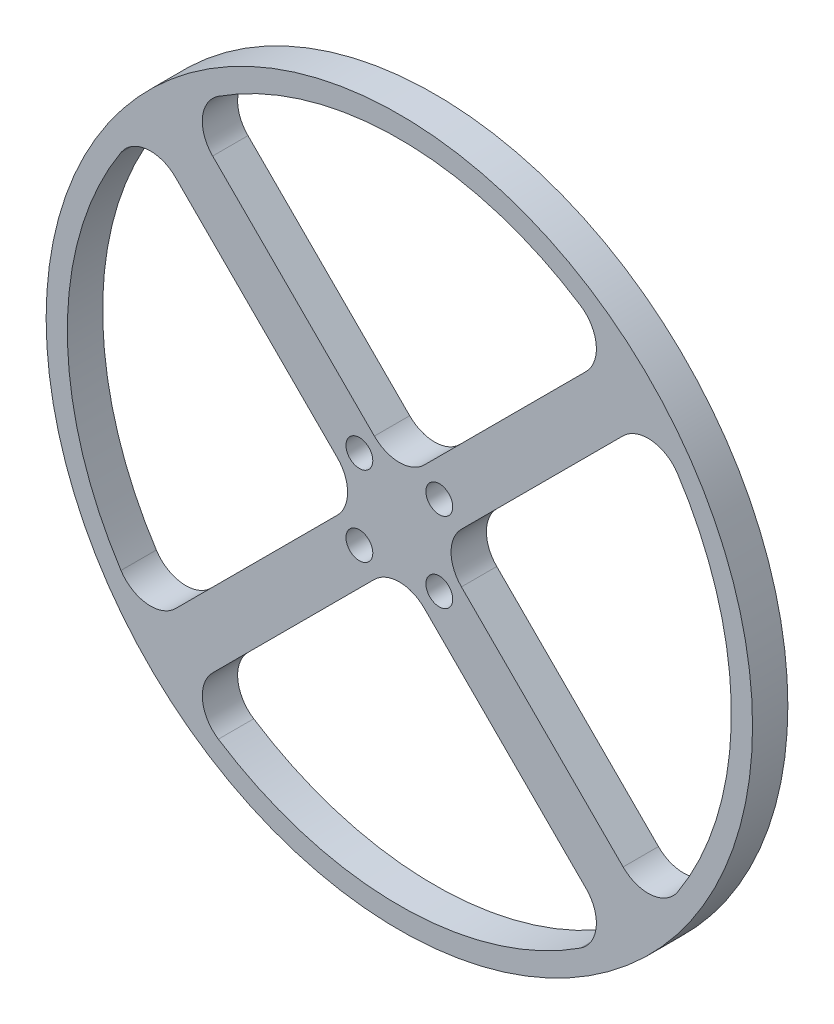
ISO-10303-21;
HEADER;
FILE_DESCRIPTION(('STEP AP214'),'2;1');
FILE_NAME('part.step','',(''),(''),'','','');
FILE_SCHEMA(('AUTOMOTIVE_DESIGN { 1 0 10303 214 1 1 1 1 }'));
ENDSEC;
DATA;
#1=APPLICATION_CONTEXT('core data for automotive mechanical design processes');
#2=APPLICATION_PROTOCOL_DEFINITION('international standard','automotive_design',2000,#1);
#3=PRODUCT_CONTEXT('',#1,'mechanical');
#4=PRODUCT('Part','Part','',(#3));
#5=PRODUCT_RELATED_PRODUCT_CATEGORY('part','',(#4));
#6=PRODUCT_DEFINITION_FORMATION('','',#4);
#7=PRODUCT_DEFINITION_CONTEXT('part definition',#1,'design');
#8=PRODUCT_DEFINITION('design','',#6,#7);
#9=PRODUCT_DEFINITION_SHAPE('','',#8);
#10=(LENGTH_UNIT() NAMED_UNIT(*) SI_UNIT(.MILLI.,.METRE.));
#11=(NAMED_UNIT(*) PLANE_ANGLE_UNIT() SI_UNIT($,.RADIAN.));
#12=(NAMED_UNIT(*) SI_UNIT($,.STERADIAN.) SOLID_ANGLE_UNIT());
#13=UNCERTAINTY_MEASURE_WITH_UNIT(LENGTH_MEASURE(1.E-05),#10,'distance_accuracy_value','');
#14=(GEOMETRIC_REPRESENTATION_CONTEXT(3) GLOBAL_UNCERTAINTY_ASSIGNED_CONTEXT((#13)) GLOBAL_UNIT_ASSIGNED_CONTEXT((#10,
#11,#12)) REPRESENTATION_CONTEXT('',''));
#15=CARTESIAN_POINT('',(0.,0.,0.));
#16=DIRECTION('',(0.,0.,1.));
#17=DIRECTION('',(1.,0.,0.));
#18=AXIS2_PLACEMENT_3D('',#15,#16,#17);
#19=CARTESIAN_POINT('',(0.,0.,5.));
#20=DIRECTION('',(0.,0.,1.));
#21=DIRECTION('',(1.,0.,0.));
#22=AXIS2_PLACEMENT_3D('',#19,#20,#21);
#23=PLANE('',#22);
#24=CARTESIAN_POINT('',(-5.65685424949235,-5.65685424949241,5.));
#25=DIRECTION('',(0.,0.,1.));
#26=DIRECTION('',(1.,0.,0.));
#27=AXIS2_PLACEMENT_3D('',#24,#25,#26);
#28=CIRCLE('',#27,1.9);
#29=CARTESIAN_POINT('',(-3.75685424949235,-5.65685424949241,5.));
#30=VERTEX_POINT('',#29);
#31=EDGE_CURVE('E750',#30,#30,#28,.T.);
#32=ORIENTED_EDGE('',*,*,#31,.F.);
#33=EDGE_LOOP('',(#32));
#34=FACE_BOUND('',#33,.T.);
#35=CARTESIAN_POINT('',(-5.65685424949243,5.65685424949233,5.));
#36=DIRECTION('',(0.,0.,1.));
#37=DIRECTION('',(1.,0.,0.));
#38=AXIS2_PLACEMENT_3D('',#35,#36,#37);
#39=CIRCLE('',#38,1.9);
#40=CARTESIAN_POINT('',(-3.75685424949243,5.65685424949233,5.));
#41=VERTEX_POINT('',#40);
#42=EDGE_CURVE('E744',#41,#41,#39,.T.);
#43=ORIENTED_EDGE('',*,*,#42,.F.);
#44=EDGE_LOOP('',(#43));
#45=FACE_BOUND('',#44,.T.);
#46=CARTESIAN_POINT('',(5.65685424949236,5.65685424949241,5.));
#47=DIRECTION('',(0.,0.,1.));
#48=DIRECTION('',(1.,0.,0.));
#49=AXIS2_PLACEMENT_3D('',#46,#47,#48);
#50=CIRCLE('',#49,1.9);
#51=CARTESIAN_POINT('',(7.55685424949235,5.65685424949241,5.));
#52=VERTEX_POINT('',#51);
#53=EDGE_CURVE('E738',#52,#52,#50,.T.);
#54=ORIENTED_EDGE('',*,*,#53,.F.);
#55=EDGE_LOOP('',(#54));
#56=FACE_BOUND('',#55,.T.);
#57=CARTESIAN_POINT('',(5.65685424949247,-5.6568542494923,5.));
#58=DIRECTION('',(0.,0.,1.));
#59=DIRECTION('',(1.,0.,0.));
#60=AXIS2_PLACEMENT_3D('',#57,#58,#59);
#61=CIRCLE('',#60,1.9);
#62=CARTESIAN_POINT('',(7.55685424949247,-5.6568542494923,5.));
#63=VERTEX_POINT('',#62);
#64=EDGE_CURVE('E732',#63,#63,#61,.T.);
#65=ORIENTED_EDGE('',*,*,#64,.F.);
#66=EDGE_LOOP('',(#65));
#67=FACE_BOUND('',#66,.T.);
#68=DIRECTION('',(-0.707106781186547,-0.707106781186548,0.));
#69=VECTOR('',#68,1.);
#70=CARTESIAN_POINT('',(5.25126265847088,0.,5.));
#71=LINE('',#70,#69);
#72=CARTESIAN_POINT('',(31.6779985812332,26.4267359227624,5.));
#73=VERTEX_POINT('',#72);
#74=CARTESIAN_POINT('',(8.78679656440362,3.53553390593268,5.));
#75=VERTEX_POINT('',#74);
#76=EDGE_CURVE('E446',#73,#75,#71,.T.);
#77=ORIENTED_EDGE('',*,*,#76,.F.);
#78=CARTESIAN_POINT('',(35.213532487166,22.8912020168296,5.));
#79=DIRECTION('',(0.,0.,1.));
#80=DIRECTION('',(1.,0.,0.));
#81=AXIS2_PLACEMENT_3D('',#78,#79,#80);
#82=CIRCLE('',#81,5.);
#83=CARTESIAN_POINT('',(39.4056196880191,25.6163451140713,5.));
#84=VERTEX_POINT('',#83);
#85=EDGE_CURVE('E312',#73,#84,#82,.F.);
#86=ORIENTED_EDGE('',*,*,#85,.T.);
#87=CARTESIAN_POINT('',(0.,0.,5.));
#88=DIRECTION('',(0.,0.,1.));
#89=DIRECTION('',(1.,0.,0.));
#90=AXIS2_PLACEMENT_3D('',#87,#88,#89);
#91=CIRCLE('',#90,47.);
#92=CARTESIAN_POINT('',(39.4056196880191,-25.6163451140713,5.));
#93=VERTEX_POINT('',#92);
#94=EDGE_CURVE('E454',#93,#84,#91,.T.);
#95=ORIENTED_EDGE('',*,*,#94,.F.);
#96=CARTESIAN_POINT('',(35.213532487166,-22.8912020168296,5.));
#97=DIRECTION('',(0.,0.,1.));
#98=DIRECTION('',(1.,0.,0.));
#99=AXIS2_PLACEMENT_3D('',#96,#97,#98);
#100=CIRCLE('',#99,5.);
#101=CARTESIAN_POINT('',(31.6779985812333,-26.4267359227624,5.));
#102=VERTEX_POINT('',#101);
#103=EDGE_CURVE('E296',#93,#102,#100,.F.);
#104=ORIENTED_EDGE('',*,*,#103,.T.);
#105=DIRECTION('',(0.707106781186548,-0.707106781186547,0.));
#106=VECTOR('',#105,1.);
#107=CARTESIAN_POINT('',(5.25126265847088,0.,5.));
#108=LINE('',#107,#106);
#109=CARTESIAN_POINT('',(8.78679656440362,-3.53553390593279,5.));
#110=VERTEX_POINT('',#109);
#111=EDGE_CURVE('E357',#110,#102,#108,.T.);
#112=ORIENTED_EDGE('',*,*,#111,.F.);
#113=CARTESIAN_POINT('',(12.3223304703364,0.,5.));
#114=DIRECTION('',(0.,0.,1.));
#115=DIRECTION('',(1.,0.,0.));
#116=AXIS2_PLACEMENT_3D('',#113,#114,#115);
#117=CIRCLE('',#116,5.);
#118=EDGE_CURVE('E308',#110,#75,#117,.F.);
#119=ORIENTED_EDGE('',*,*,#118,.T.);
#120=EDGE_LOOP('',(#77,#86,#95,#104,#112,#119));
#121=FACE_BOUND('',#120,.T.);
#122=DIRECTION('',(0.707106781186547,-0.707106781186548,0.));
#123=VECTOR('',#122,1.);
#124=CARTESIAN_POINT('',(-30.5045069156155,35.7557695740864,5.));
#125=LINE('',#124,#123);
#126=CARTESIAN_POINT('',(-26.4267359227624,31.6779985812333,5.));
#127=VERTEX_POINT('',#126);
#128=CARTESIAN_POINT('',(-3.53553390593277,8.78679656440363,5.));
#129=VERTEX_POINT('',#128);
#130=EDGE_CURVE('E361',#127,#129,#125,.T.);
#131=ORIENTED_EDGE('',*,*,#130,.F.);
#132=CARTESIAN_POINT('',(-22.8912020168296,35.213532487166,5.));
#133=DIRECTION('',(0.,0.,1.));
#134=DIRECTION('',(1.,0.,0.));
#135=AXIS2_PLACEMENT_3D('',#132,#133,#134);
#136=CIRCLE('',#135,5.);
#137=CARTESIAN_POINT('',(-25.6163451140713,39.4056196880191,5.));
#138=VERTEX_POINT('',#137);
#139=EDGE_CURVE('E47',#127,#138,#136,.F.);
#140=ORIENTED_EDGE('',*,*,#139,.T.);
#141=CARTESIAN_POINT('',(0.,0.,5.));
#142=DIRECTION('',(0.,0.,1.));
#143=DIRECTION('',(1.,0.,0.));
#144=AXIS2_PLACEMENT_3D('',#141,#142,#143);
#145=CIRCLE('',#144,47.);
#146=CARTESIAN_POINT('',(25.6163451140713,39.4056196880191,5.));
#147=VERTEX_POINT('',#146);
#148=EDGE_CURVE('E359',#147,#138,#145,.T.);
#149=ORIENTED_EDGE('',*,*,#148,.F.);
#150=CARTESIAN_POINT('',(22.8912020168296,35.213532487166,5.));
#151=DIRECTION('',(0.,0.,1.));
#152=DIRECTION('',(1.,0.,0.));
#153=AXIS2_PLACEMENT_3D('',#150,#151,#152);
#154=CIRCLE('',#153,5.);
#155=CARTESIAN_POINT('',(26.4267359227624,31.6779985812333,5.));
#156=VERTEX_POINT('',#155);
#157=EDGE_CURVE('E205',#147,#156,#154,.F.);
#158=ORIENTED_EDGE('',*,*,#157,.T.);
#159=DIRECTION('',(0.707106781186548,0.707106781186547,0.));
#160=VECTOR('',#159,1.);
#161=CARTESIAN_POINT('',(30.5045069156155,35.7557695740864,5.));
#162=LINE('',#161,#160);
#163=CARTESIAN_POINT('',(3.53553390593271,8.78679656440363,5.));
#164=VERTEX_POINT('',#163);
#165=EDGE_CURVE('E363',#164,#156,#162,.T.);
#166=ORIENTED_EDGE('',*,*,#165,.F.);
#167=CARTESIAN_POINT('',(0.,12.3223304703364,5.));
#168=DIRECTION('',(0.,0.,1.));
#169=DIRECTION('',(1.,0.,0.));
#170=AXIS2_PLACEMENT_3D('',#167,#168,#169);
#171=CIRCLE('',#170,5.);
#172=EDGE_CURVE('E280',#164,#129,#171,.F.);
#173=ORIENTED_EDGE('',*,*,#172,.T.);
#174=EDGE_LOOP('',(#131,#140,#149,#158,#166,#173));
#175=FACE_BOUND('',#174,.T.);
#176=CARTESIAN_POINT('',(0.,0.,5.));
#177=DIRECTION('',(0.,0.,1.));
#178=DIRECTION('',(1.,0.,0.));
#179=AXIS2_PLACEMENT_3D('',#176,#177,#178);
#180=CIRCLE('',#179,50.);
#181=CARTESIAN_POINT('',(50.,0.,5.));
#182=VERTEX_POINT('',#181);
#183=EDGE_CURVE('E217',#182,#182,#180,.T.);
#184=ORIENTED_EDGE('',*,*,#183,.T.);
#185=EDGE_LOOP('',(#184));
#186=FACE_BOUND('',#185,.T.);
#187=CARTESIAN_POINT('',(0.,0.,5.));
#188=DIRECTION('',(0.,0.,1.));
#189=DIRECTION('',(1.,0.,0.));
#190=AXIS2_PLACEMENT_3D('',#187,#188,#189);
#191=CIRCLE('',#190,47.);
#192=CARTESIAN_POINT('',(-39.4056196880191,25.6163451140713,5.));
#193=VERTEX_POINT('',#192);
#194=CARTESIAN_POINT('',(-39.4056196880191,-25.6163451140713,5.));
#195=VERTEX_POINT('',#194);
#196=EDGE_CURVE('E343',#193,#195,#191,.T.);
#197=ORIENTED_EDGE('',*,*,#196,.F.);
#198=CARTESIAN_POINT('',(-35.213532487166,22.8912020168297,5.));
#199=DIRECTION('',(0.,0.,1.));
#200=DIRECTION('',(1.,0.,0.));
#201=AXIS2_PLACEMENT_3D('',#198,#199,#200);
#202=CIRCLE('',#201,5.);
#203=CARTESIAN_POINT('',(-31.6779985812333,26.4267359227624,5.));
#204=VERTEX_POINT('',#203);
#205=EDGE_CURVE('E11',#193,#204,#202,.F.);
#206=ORIENTED_EDGE('',*,*,#205,.T.);
#207=DIRECTION('',(-0.707106781186549,0.707106781186545,0.));
#208=VECTOR('',#207,1.);
#209=CARTESIAN_POINT('',(-5.25126265847084,1.40256674142815E-13,5.));
#210=LINE('',#209,#208);
#211=CARTESIAN_POINT('',(-8.78679656440359,3.53553390593287,5.));
#212=VERTEX_POINT('',#211);
#213=EDGE_CURVE('E341',#212,#204,#210,.T.);
#214=ORIENTED_EDGE('',*,*,#213,.F.);
#215=CARTESIAN_POINT('',(-12.3223304703363,1.24466409401336E-13,5.));
#216=DIRECTION('',(0.,0.,1.));
#217=DIRECTION('',(1.,0.,0.));
#218=AXIS2_PLACEMENT_3D('',#215,#216,#217);
#219=CIRCLE('',#218,5.);
#220=CARTESIAN_POINT('',(-8.78679656440358,-3.53553390593261,5.));
#221=VERTEX_POINT('',#220);
#222=EDGE_CURVE('E284',#212,#221,#219,.F.);
#223=ORIENTED_EDGE('',*,*,#222,.T.);
#224=DIRECTION('',(0.707106781186546,0.707106781186549,0.));
#225=VECTOR('',#224,1.);
#226=CARTESIAN_POINT('',(-5.25126265847084,1.40256674142815E-13,5.));
#227=LINE('',#226,#225);
#228=CARTESIAN_POINT('',(-31.6779985812333,-26.4267359227624,5.));
#229=VERTEX_POINT('',#228);
#230=EDGE_CURVE('E348',#229,#221,#227,.T.);
#231=ORIENTED_EDGE('',*,*,#230,.F.);
#232=CARTESIAN_POINT('',(-35.213532487166,-22.8912020168296,5.));
#233=DIRECTION('',(0.,0.,1.));
#234=DIRECTION('',(1.,0.,0.));
#235=AXIS2_PLACEMENT_3D('',#232,#233,#234);
#236=CIRCLE('',#235,5.);
#237=EDGE_CURVE('E288',#229,#195,#236,.F.);
#238=ORIENTED_EDGE('',*,*,#237,.T.);
#239=EDGE_LOOP('',(#197,#206,#214,#223,#231,#238));
#240=FACE_BOUND('',#239,.T.);
#241=DIRECTION('',(-0.707106781186546,0.707106781186549,0.));
#242=VECTOR('',#241,1.);
#243=CARTESIAN_POINT('',(1.0258118907513E-13,-5.25126265847084,5.));
#244=LINE('',#243,#242);
#245=CARTESIAN_POINT('',(26.4267359227624,-31.6779985812333,5.));
#246=VERTEX_POINT('',#245);
#247=CARTESIAN_POINT('',(3.53553390593284,-8.78679656440359,5.));
#248=VERTEX_POINT('',#247);
#249=EDGE_CURVE('E712',#246,#248,#244,.T.);
#250=ORIENTED_EDGE('',*,*,#249,.F.);
#251=CARTESIAN_POINT('',(22.8912020168296,-35.213532487166,5.));
#252=DIRECTION('',(0.,0.,1.));
#253=DIRECTION('',(1.,0.,0.));
#254=AXIS2_PLACEMENT_3D('',#251,#252,#253);
#255=CIRCLE('',#254,5.);
#256=CARTESIAN_POINT('',(25.6163451140713,-39.4056196880191,5.));
#257=VERTEX_POINT('',#256);
#258=EDGE_CURVE('E292',#246,#257,#255,.F.);
#259=ORIENTED_EDGE('',*,*,#258,.T.);
#260=CARTESIAN_POINT('',(0.,0.,5.));
#261=DIRECTION('',(0.,0.,1.));
#262=DIRECTION('',(1.,0.,0.));
#263=AXIS2_PLACEMENT_3D('',#260,#261,#262);
#264=CIRCLE('',#263,47.);
#265=CARTESIAN_POINT('',(-25.6163451140713,-39.4056196880191,5.));
#266=VERTEX_POINT('',#265);
#267=EDGE_CURVE('E706',#266,#257,#264,.T.);
#268=ORIENTED_EDGE('',*,*,#267,.F.);
#269=CARTESIAN_POINT('',(-22.8912020168296,-35.213532487166,5.));
#270=DIRECTION('',(0.,0.,1.));
#271=DIRECTION('',(1.,0.,0.));
#272=AXIS2_PLACEMENT_3D('',#269,#270,#271);
#273=CIRCLE('',#272,5.);
#274=CARTESIAN_POINT('',(-26.4267359227624,-31.6779985812333,5.));
#275=VERTEX_POINT('',#274);
#276=EDGE_CURVE('E300',#266,#275,#273,.F.);
#277=ORIENTED_EDGE('',*,*,#276,.T.);
#278=DIRECTION('',(-0.707106781186548,-0.707106781186547,0.));
#279=VECTOR('',#278,1.);
#280=CARTESIAN_POINT('',(1.0258118907513E-13,-5.25126265847084,5.));
#281=LINE('',#280,#279);
#282=CARTESIAN_POINT('',(-3.53553390593264,-8.78679656440358,5.));
#283=VERTEX_POINT('',#282);
#284=EDGE_CURVE('E464',#283,#275,#281,.T.);
#285=ORIENTED_EDGE('',*,*,#284,.F.);
#286=CARTESIAN_POINT('',(0.,-12.3223304703363,5.));
#287=DIRECTION('',(0.,0.,1.));
#288=DIRECTION('',(1.,0.,0.));
#289=AXIS2_PLACEMENT_3D('',#286,#287,#288);
#290=CIRCLE('',#289,5.);
#291=EDGE_CURVE('E304',#283,#248,#290,.F.);
#292=ORIENTED_EDGE('',*,*,#291,.T.);
#293=EDGE_LOOP('',(#250,#259,#268,#277,#285,#292));
#294=FACE_BOUND('',#293,.T.);
#295=ADVANCED_FACE('F32',(#34,#45,#56,#67,#121,#175,#186,#240,#294),#23,.T.);
#296=CARTESIAN_POINT('',(0.,0.,0.));
#297=DIRECTION('',(0.,0.,1.));
#298=DIRECTION('',(1.,0.,0.));
#299=AXIS2_PLACEMENT_3D('',#296,#297,#298);
#300=PLANE('',#299);
#301=CARTESIAN_POINT('',(-5.65685424949235,-5.65685424949241,0.));
#302=DIRECTION('',(0.,0.,1.));
#303=DIRECTION('',(1.,0.,0.));
#304=AXIS2_PLACEMENT_3D('',#301,#302,#303);
#305=CIRCLE('',#304,1.9);
#306=CARTESIAN_POINT('',(-3.75685424949235,-5.65685424949241,0.));
#307=VERTEX_POINT('',#306);
#308=EDGE_CURVE('E747',#307,#307,#305,.T.);
#309=ORIENTED_EDGE('',*,*,#308,.T.);
#310=EDGE_LOOP('',(#309));
#311=FACE_BOUND('',#310,.T.);
#312=CARTESIAN_POINT('',(-5.65685424949243,5.65685424949233,0.));
#313=DIRECTION('',(0.,0.,1.));
#314=DIRECTION('',(1.,0.,0.));
#315=AXIS2_PLACEMENT_3D('',#312,#313,#314);
#316=CIRCLE('',#315,1.9);
#317=CARTESIAN_POINT('',(-3.75685424949243,5.65685424949233,0.));
#318=VERTEX_POINT('',#317);
#319=EDGE_CURVE('E741',#318,#318,#316,.T.);
#320=ORIENTED_EDGE('',*,*,#319,.T.);
#321=EDGE_LOOP('',(#320));
#322=FACE_BOUND('',#321,.T.);
#323=CARTESIAN_POINT('',(5.65685424949236,5.65685424949241,0.));
#324=DIRECTION('',(0.,0.,1.));
#325=DIRECTION('',(1.,0.,0.));
#326=AXIS2_PLACEMENT_3D('',#323,#324,#325);
#327=CIRCLE('',#326,1.9);
#328=CARTESIAN_POINT('',(7.55685424949235,5.65685424949241,0.));
#329=VERTEX_POINT('',#328);
#330=EDGE_CURVE('E735',#329,#329,#327,.T.);
#331=ORIENTED_EDGE('',*,*,#330,.T.);
#332=EDGE_LOOP('',(#331));
#333=FACE_BOUND('',#332,.T.);
#334=CARTESIAN_POINT('',(5.65685424949247,-5.6568542494923,0.));
#335=DIRECTION('',(0.,0.,1.));
#336=DIRECTION('',(1.,0.,0.));
#337=AXIS2_PLACEMENT_3D('',#334,#335,#336);
#338=CIRCLE('',#337,1.9);
#339=CARTESIAN_POINT('',(7.55685424949247,-5.6568542494923,0.));
#340=VERTEX_POINT('',#339);
#341=EDGE_CURVE('E726',#340,#340,#338,.T.);
#342=ORIENTED_EDGE('',*,*,#341,.T.);
#343=EDGE_LOOP('',(#342));
#344=FACE_BOUND('',#343,.T.);
#345=DIRECTION('',(0.707106781186548,-0.707106781186547,0.));
#346=VECTOR('',#345,1.);
#347=CARTESIAN_POINT('',(5.25126265847088,0.,0.));
#348=LINE('',#347,#346);
#349=CARTESIAN_POINT('',(8.78679656440362,-3.53553390593279,0.));
#350=VERTEX_POINT('',#349);
#351=CARTESIAN_POINT('',(31.6779985812333,-26.4267359227624,0.));
#352=VERTEX_POINT('',#351);
#353=EDGE_CURVE('E352',#350,#352,#348,.T.);
#354=ORIENTED_EDGE('',*,*,#353,.T.);
#355=CARTESIAN_POINT('',(35.213532487166,-22.8912020168296,0.));
#356=DIRECTION('',(0.,0.,1.));
#357=DIRECTION('',(1.,0.,0.));
#358=AXIS2_PLACEMENT_3D('',#355,#356,#357);
#359=CIRCLE('',#358,5.);
#360=CARTESIAN_POINT('',(39.4056196880191,-25.6163451140713,0.));
#361=VERTEX_POINT('',#360);
#362=EDGE_CURVE('E294',#352,#361,#359,.T.);
#363=ORIENTED_EDGE('',*,*,#362,.T.);
#364=CARTESIAN_POINT('',(0.,0.,0.));
#365=DIRECTION('',(0.,0.,1.));
#366=DIRECTION('',(1.,0.,0.));
#367=AXIS2_PLACEMENT_3D('',#364,#365,#366);
#368=CIRCLE('',#367,47.);
#369=CARTESIAN_POINT('',(39.4056196880191,25.6163451140713,0.));
#370=VERTEX_POINT('',#369);
#371=EDGE_CURVE('E461',#361,#370,#368,.T.);
#372=ORIENTED_EDGE('',*,*,#371,.T.);
#373=CARTESIAN_POINT('',(35.213532487166,22.8912020168296,0.));
#374=DIRECTION('',(0.,0.,1.));
#375=DIRECTION('',(1.,0.,0.));
#376=AXIS2_PLACEMENT_3D('',#373,#374,#375);
#377=CIRCLE('',#376,5.);
#378=CARTESIAN_POINT('',(31.6779985812332,26.4267359227624,0.));
#379=VERTEX_POINT('',#378);
#380=EDGE_CURVE('E310',#370,#379,#377,.T.);
#381=ORIENTED_EDGE('',*,*,#380,.T.);
#382=DIRECTION('',(-0.707106781186547,-0.707106781186548,0.));
#383=VECTOR('',#382,1.);
#384=CARTESIAN_POINT('',(5.25126265847088,0.,0.));
#385=LINE('',#384,#383);
#386=CARTESIAN_POINT('',(8.78679656440362,3.53553390593268,0.));
#387=VERTEX_POINT('',#386);
#388=EDGE_CURVE('E463',#379,#387,#385,.T.);
#389=ORIENTED_EDGE('',*,*,#388,.T.);
#390=CARTESIAN_POINT('',(12.3223304703364,0.,0.));
#391=DIRECTION('',(0.,0.,1.));
#392=DIRECTION('',(1.,0.,0.));
#393=AXIS2_PLACEMENT_3D('',#390,#391,#392);
#394=CIRCLE('',#393,5.);
#395=EDGE_CURVE('E306',#387,#350,#394,.T.);
#396=ORIENTED_EDGE('',*,*,#395,.T.);
#397=EDGE_LOOP('',(#354,#363,#372,#381,#389,#396));
#398=FACE_BOUND('',#397,.T.);
#399=DIRECTION('',(0.707106781186548,0.707106781186547,0.));
#400=VECTOR('',#399,1.);
#401=CARTESIAN_POINT('',(30.5045069156155,35.7557695740864,0.));
#402=LINE('',#401,#400);
#403=CARTESIAN_POINT('',(3.53553390593271,8.78679656440363,0.));
#404=VERTEX_POINT('',#403);
#405=CARTESIAN_POINT('',(26.4267359227624,31.6779985812333,0.));
#406=VERTEX_POINT('',#405);
#407=EDGE_CURVE('E214',#404,#406,#402,.T.);
#408=ORIENTED_EDGE('',*,*,#407,.T.);
#409=CARTESIAN_POINT('',(22.8912020168296,35.213532487166,0.));
#410=DIRECTION('',(0.,0.,1.));
#411=DIRECTION('',(1.,0.,0.));
#412=AXIS2_PLACEMENT_3D('',#409,#410,#411);
#413=CIRCLE('',#412,5.);
#414=CARTESIAN_POINT('',(25.6163451140713,39.4056196880191,0.));
#415=VERTEX_POINT('',#414);
#416=EDGE_CURVE('E314',#406,#415,#413,.T.);
#417=ORIENTED_EDGE('',*,*,#416,.T.);
#418=CARTESIAN_POINT('',(0.,0.,0.));
#419=DIRECTION('',(0.,0.,1.));
#420=DIRECTION('',(1.,0.,0.));
#421=AXIS2_PLACEMENT_3D('',#418,#419,#420);
#422=CIRCLE('',#421,47.);
#423=CARTESIAN_POINT('',(-25.6163451140713,39.4056196880191,0.));
#424=VERTEX_POINT('',#423);
#425=EDGE_CURVE('E200',#415,#424,#422,.T.);
#426=ORIENTED_EDGE('',*,*,#425,.T.);
#427=CARTESIAN_POINT('',(-22.8912020168296,35.213532487166,0.));
#428=DIRECTION('',(0.,0.,1.));
#429=DIRECTION('',(1.,0.,0.));
#430=AXIS2_PLACEMENT_3D('',#427,#428,#429);
#431=CIRCLE('',#430,5.);
#432=CARTESIAN_POINT('',(-26.4267359227624,31.6779985812333,0.));
#433=VERTEX_POINT('',#432);
#434=EDGE_CURVE('E194',#424,#433,#431,.T.);
#435=ORIENTED_EDGE('',*,*,#434,.T.);
#436=DIRECTION('',(0.707106781186547,-0.707106781186548,0.));
#437=VECTOR('',#436,1.);
#438=CARTESIAN_POINT('',(-30.5045069156155,35.7557695740864,0.));
#439=LINE('',#438,#437);
#440=CARTESIAN_POINT('',(-3.53553390593277,8.78679656440363,0.));
#441=VERTEX_POINT('',#440);
#442=EDGE_CURVE('E199',#433,#441,#439,.T.);
#443=ORIENTED_EDGE('',*,*,#442,.T.);
#444=CARTESIAN_POINT('',(0.,12.3223304703364,0.));
#445=DIRECTION('',(0.,0.,1.));
#446=DIRECTION('',(1.,0.,0.));
#447=AXIS2_PLACEMENT_3D('',#444,#445,#446);
#448=CIRCLE('',#447,5.);
#449=EDGE_CURVE('E278',#441,#404,#448,.T.);
#450=ORIENTED_EDGE('',*,*,#449,.T.);
#451=EDGE_LOOP('',(#408,#417,#426,#435,#443,#450));
#452=FACE_BOUND('',#451,.T.);
#453=CARTESIAN_POINT('',(0.,0.,0.));
#454=DIRECTION('',(0.,0.,1.));
#455=DIRECTION('',(1.,0.,0.));
#456=AXIS2_PLACEMENT_3D('',#453,#454,#455);
#457=CIRCLE('',#456,50.);
#458=CARTESIAN_POINT('',(50.,0.,0.));
#459=VERTEX_POINT('',#458);
#460=EDGE_CURVE('E222',#459,#459,#457,.T.);
#461=ORIENTED_EDGE('',*,*,#460,.F.);
#462=EDGE_LOOP('',(#461));
#463=FACE_BOUND('',#462,.T.);
#464=DIRECTION('',(0.707106781186546,0.707106781186549,0.));
#465=VECTOR('',#464,1.);
#466=CARTESIAN_POINT('',(-5.25126265847084,1.40256674142815E-13,0.));
#467=LINE('',#466,#465);
#468=CARTESIAN_POINT('',(-31.6779985812333,-26.4267359227624,0.));
#469=VERTEX_POINT('',#468);
#470=CARTESIAN_POINT('',(-8.78679656440358,-3.53553390593261,0.));
#471=VERTEX_POINT('',#470);
#472=EDGE_CURVE('E334',#469,#471,#467,.T.);
#473=ORIENTED_EDGE('',*,*,#472,.T.);
#474=CARTESIAN_POINT('',(-12.3223304703363,1.24466409401336E-13,0.));
#475=DIRECTION('',(0.,0.,1.));
#476=DIRECTION('',(1.,0.,0.));
#477=AXIS2_PLACEMENT_3D('',#474,#475,#476);
#478=CIRCLE('',#477,5.);
#479=CARTESIAN_POINT('',(-8.78679656440359,3.53553390593287,0.));
#480=VERTEX_POINT('',#479);
#481=EDGE_CURVE('E282',#471,#480,#478,.T.);
#482=ORIENTED_EDGE('',*,*,#481,.T.);
#483=DIRECTION('',(-0.707106781186549,0.707106781186545,0.));
#484=VECTOR('',#483,1.);
#485=CARTESIAN_POINT('',(-5.25126265847084,1.40256674142815E-13,0.));
#486=LINE('',#485,#484);
#487=CARTESIAN_POINT('',(-31.6779985812333,26.4267359227624,0.));
#488=VERTEX_POINT('',#487);
#489=EDGE_CURVE('E325',#480,#488,#486,.T.);
#490=ORIENTED_EDGE('',*,*,#489,.T.);
#491=CARTESIAN_POINT('',(-35.213532487166,22.8912020168297,0.));
#492=DIRECTION('',(0.,0.,1.));
#493=DIRECTION('',(1.,0.,0.));
#494=AXIS2_PLACEMENT_3D('',#491,#492,#493);
#495=CIRCLE('',#494,5.);
#496=CARTESIAN_POINT('',(-39.4056196880191,25.6163451140713,0.));
#497=VERTEX_POINT('',#496);
#498=EDGE_CURVE('E40',#488,#497,#495,.T.);
#499=ORIENTED_EDGE('',*,*,#498,.T.);
#500=CARTESIAN_POINT('',(0.,0.,0.));
#501=DIRECTION('',(0.,0.,1.));
#502=DIRECTION('',(1.,0.,0.));
#503=AXIS2_PLACEMENT_3D('',#500,#501,#502);
#504=CIRCLE('',#503,47.);
#505=CARTESIAN_POINT('',(-39.4056196880191,-25.6163451140713,0.));
#506=VERTEX_POINT('',#505);
#507=EDGE_CURVE('E323',#497,#506,#504,.T.);
#508=ORIENTED_EDGE('',*,*,#507,.T.);
#509=CARTESIAN_POINT('',(-35.213532487166,-22.8912020168296,0.));
#510=DIRECTION('',(0.,0.,1.));
#511=DIRECTION('',(1.,0.,0.));
#512=AXIS2_PLACEMENT_3D('',#509,#510,#511);
#513=CIRCLE('',#512,5.);
#514=EDGE_CURVE('E286',#506,#469,#513,.T.);
#515=ORIENTED_EDGE('',*,*,#514,.T.);
#516=EDGE_LOOP('',(#473,#482,#490,#499,#508,#515));
#517=FACE_BOUND('',#516,.T.);
#518=DIRECTION('',(-0.707106781186548,-0.707106781186547,0.));
#519=VECTOR('',#518,1.);
#520=CARTESIAN_POINT('',(1.0258118907513E-13,-5.25126265847084,0.));
#521=LINE('',#520,#519);
#522=CARTESIAN_POINT('',(-3.53553390593264,-8.78679656440358,0.));
#523=VERTEX_POINT('',#522);
#524=CARTESIAN_POINT('',(-26.4267359227624,-31.6779985812333,0.));
#525=VERTEX_POINT('',#524);
#526=EDGE_CURVE('E713',#523,#525,#521,.T.);
#527=ORIENTED_EDGE('',*,*,#526,.T.);
#528=CARTESIAN_POINT('',(-22.8912020168296,-35.213532487166,0.));
#529=DIRECTION('',(0.,0.,1.));
#530=DIRECTION('',(1.,0.,0.));
#531=AXIS2_PLACEMENT_3D('',#528,#529,#530);
#532=CIRCLE('',#531,5.);
#533=CARTESIAN_POINT('',(-25.6163451140713,-39.4056196880191,0.));
#534=VERTEX_POINT('',#533);
#535=EDGE_CURVE('E298',#525,#534,#532,.T.);
#536=ORIENTED_EDGE('',*,*,#535,.T.);
#537=CARTESIAN_POINT('',(0.,0.,0.));
#538=DIRECTION('',(0.,0.,1.));
#539=DIRECTION('',(1.,0.,0.));
#540=AXIS2_PLACEMENT_3D('',#537,#538,#539);
#541=CIRCLE('',#540,47.);
#542=CARTESIAN_POINT('',(25.6163451140713,-39.4056196880191,0.));
#543=VERTEX_POINT('',#542);
#544=EDGE_CURVE('E721',#534,#543,#541,.T.);
#545=ORIENTED_EDGE('',*,*,#544,.T.);
#546=CARTESIAN_POINT('',(22.8912020168296,-35.213532487166,0.));
#547=DIRECTION('',(0.,0.,1.));
#548=DIRECTION('',(1.,0.,0.));
#549=AXIS2_PLACEMENT_3D('',#546,#547,#548);
#550=CIRCLE('',#549,5.);
#551=CARTESIAN_POINT('',(26.4267359227624,-31.6779985812333,0.));
#552=VERTEX_POINT('',#551);
#553=EDGE_CURVE('E290',#543,#552,#550,.T.);
#554=ORIENTED_EDGE('',*,*,#553,.T.);
#555=DIRECTION('',(-0.707106781186546,0.707106781186549,0.));
#556=VECTOR('',#555,1.);
#557=CARTESIAN_POINT('',(1.0258118907513E-13,-5.25126265847084,0.));
#558=LINE('',#557,#556);
#559=CARTESIAN_POINT('',(3.53553390593284,-8.78679656440359,0.));
#560=VERTEX_POINT('',#559);
#561=EDGE_CURVE('E720',#552,#560,#558,.T.);
#562=ORIENTED_EDGE('',*,*,#561,.T.);
#563=CARTESIAN_POINT('',(0.,-12.3223304703363,0.));
#564=DIRECTION('',(0.,0.,1.));
#565=DIRECTION('',(1.,0.,0.));
#566=AXIS2_PLACEMENT_3D('',#563,#564,#565);
#567=CIRCLE('',#566,5.);
#568=EDGE_CURVE('E302',#560,#523,#567,.T.);
#569=ORIENTED_EDGE('',*,*,#568,.T.);
#570=EDGE_LOOP('',(#527,#536,#545,#554,#562,#569));
#571=FACE_BOUND('',#570,.T.);
#572=ADVANCED_FACE('F197',(#311,#322,#333,#344,#398,#452,#463,#517,#571),#300,.F.);
#573=CARTESIAN_POINT('',(0.,0.,5.));
#574=DIRECTION('',(0.,0.,-1.));
#575=DIRECTION('',(-1.,0.,0.));
#576=AXIS2_PLACEMENT_3D('',#573,#574,#575);
#577=CYLINDRICAL_SURFACE('',#576,50.);
#578=ORIENTED_EDGE('',*,*,#183,.F.);
#579=EDGE_LOOP('',(#578));
#580=FACE_BOUND('',#579,.T.);
#581=ORIENTED_EDGE('',*,*,#460,.T.);
#582=EDGE_LOOP('',(#581));
#583=FACE_BOUND('',#582,.T.);
#584=ADVANCED_FACE('F396',(#580,#583),#577,.T.);
#585=CARTESIAN_POINT('',(0.,0.,5.));
#586=DIRECTION('',(0.,0.,-1.));
#587=DIRECTION('',(-1.,0.,0.));
#588=AXIS2_PLACEMENT_3D('',#585,#586,#587);
#589=CYLINDRICAL_SURFACE('',#588,47.);
#590=ORIENTED_EDGE('',*,*,#425,.F.);
#591=DIRECTION('',(0.,0.,-1.));
#592=VECTOR('',#591,1.);
#593=CARTESIAN_POINT('',(25.6163451140713,39.4056196880191,5.));
#594=LINE('',#593,#592);
#595=EDGE_CURVE('E54',#415,#147,#594,.F.);
#596=ORIENTED_EDGE('',*,*,#595,.T.);
#597=ORIENTED_EDGE('',*,*,#148,.T.);
#598=DIRECTION('',(0.,0.,-1.));
#599=VECTOR('',#598,1.);
#600=CARTESIAN_POINT('',(-25.6163451140713,39.4056196880191,5.));
#601=LINE('',#600,#599);
#602=EDGE_CURVE('E275',#138,#424,#601,.T.);
#603=ORIENTED_EDGE('',*,*,#602,.T.);
#604=EDGE_LOOP('',(#590,#596,#597,#603));
#605=FACE_BOUND('',#604,.T.);
#606=ADVANCED_FACE('F402',(#605),#589,.F.);
#607=CARTESIAN_POINT('',(-30.5045069156155,35.7557695740864,5.));
#608=DIRECTION('',(0.707106781186548,0.707106781186547,0.));
#609=DIRECTION('',(-0.707106781186547,0.707106781186548,0.));
#610=AXIS2_PLACEMENT_3D('',#607,#608,#609);
#611=PLANE('',#610);
#612=ORIENTED_EDGE('',*,*,#130,.T.);
#613=DIRECTION('',(0.,0.,-1.));
#614=VECTOR('',#613,1.);
#615=CARTESIAN_POINT('',(-3.53553390593277,8.78679656440364,0.));
#616=LINE('',#615,#614);
#617=EDGE_CURVE('E213',#129,#441,#616,.T.);
#618=ORIENTED_EDGE('',*,*,#617,.T.);
#619=ORIENTED_EDGE('',*,*,#442,.F.);
#620=DIRECTION('',(0.,0.,1.));
#621=VECTOR('',#620,1.);
#622=CARTESIAN_POINT('',(-26.4267359227624,31.6779985812333,5.));
#623=LINE('',#622,#621);
#624=EDGE_CURVE('E211',#433,#127,#623,.T.);
#625=ORIENTED_EDGE('',*,*,#624,.T.);
#626=EDGE_LOOP('',(#612,#618,#619,#625));
#627=FACE_BOUND('',#626,.T.);
#628=ADVANCED_FACE('F210',(#627),#611,.T.);
#629=CARTESIAN_POINT('',(30.5045069156155,35.7557695740864,5.));
#630=DIRECTION('',(-0.707106781186547,0.707106781186548,0.));
#631=DIRECTION('',(-0.707106781186548,-0.707106781186547,0.));
#632=AXIS2_PLACEMENT_3D('',#629,#630,#631);
#633=PLANE('',#632);
#634=ORIENTED_EDGE('',*,*,#407,.F.);
#635=DIRECTION('',(0.,0.,-1.));
#636=VECTOR('',#635,1.);
#637=CARTESIAN_POINT('',(3.53553390593271,8.78679656440363,5.));
#638=LINE('',#637,#636);
#639=EDGE_CURVE('E228',#404,#164,#638,.F.);
#640=ORIENTED_EDGE('',*,*,#639,.T.);
#641=ORIENTED_EDGE('',*,*,#165,.T.);
#642=DIRECTION('',(0.,0.,1.));
#643=VECTOR('',#642,1.);
#644=CARTESIAN_POINT('',(26.4267359227624,31.6779985812333,0.));
#645=LINE('',#644,#643);
#646=EDGE_CURVE('E219',#156,#406,#645,.F.);
#647=ORIENTED_EDGE('',*,*,#646,.T.);
#648=EDGE_LOOP('',(#634,#640,#641,#647));
#649=FACE_BOUND('',#648,.T.);
#650=ADVANCED_FACE('F370',(#649),#633,.T.);
#651=CARTESIAN_POINT('',(-5.25126265847084,1.40256674142815E-13,5.));
#652=DIRECTION('',(-0.707106781186546,-0.70710678118655,0.));
#653=DIRECTION('',(0.70710678118655,-0.707106781186546,0.));
#654=AXIS2_PLACEMENT_3D('',#651,#652,#653);
#655=PLANE('',#654);
#656=ORIENTED_EDGE('',*,*,#489,.F.);
#657=DIRECTION('',(0.,0.,-1.));
#658=VECTOR('',#657,1.);
#659=CARTESIAN_POINT('',(-8.78679656440359,3.53553390593287,5.));
#660=LINE('',#659,#658);
#661=EDGE_CURVE('E238',#480,#212,#660,.F.);
#662=ORIENTED_EDGE('',*,*,#661,.T.);
#663=ORIENTED_EDGE('',*,*,#213,.T.);
#664=DIRECTION('',(0.,0.,1.));
#665=VECTOR('',#664,1.);
#666=CARTESIAN_POINT('',(-31.6779985812333,26.4267359227624,0.));
#667=LINE('',#666,#665);
#668=EDGE_CURVE('E235',#204,#488,#667,.F.);
#669=ORIENTED_EDGE('',*,*,#668,.T.);
#670=EDGE_LOOP('',(#656,#662,#663,#669));
#671=FACE_BOUND('',#670,.T.);
#672=ADVANCED_FACE('F345',(#671),#655,.T.);
#673=CARTESIAN_POINT('',(0.,0.,5.));
#674=DIRECTION('',(0.,0.,-1.));
#675=DIRECTION('',(-1.,0.,0.));
#676=AXIS2_PLACEMENT_3D('',#673,#674,#675);
#677=CYLINDRICAL_SURFACE('',#676,47.);
#678=ORIENTED_EDGE('',*,*,#196,.T.);
#679=DIRECTION('',(0.,0.,-1.));
#680=VECTOR('',#679,1.);
#681=CARTESIAN_POINT('',(-39.4056196880191,-25.6163451140713,5.));
#682=LINE('',#681,#680);
#683=EDGE_CURVE('E242',#195,#506,#682,.T.);
#684=ORIENTED_EDGE('',*,*,#683,.T.);
#685=ORIENTED_EDGE('',*,*,#507,.F.);
#686=DIRECTION('',(0.,0.,-1.));
#687=VECTOR('',#686,1.);
#688=CARTESIAN_POINT('',(-39.4056196880191,25.6163451140713,5.));
#689=LINE('',#688,#687);
#690=EDGE_CURVE('E240',#497,#193,#689,.F.);
#691=ORIENTED_EDGE('',*,*,#690,.T.);
#692=EDGE_LOOP('',(#678,#684,#685,#691));
#693=FACE_BOUND('',#692,.T.);
#694=ADVANCED_FACE('F331',(#693),#677,.F.);
#695=CARTESIAN_POINT('',(-5.25126265847084,1.40256674142815E-13,5.));
#696=DIRECTION('',(-0.707106781186549,0.707106781186546,0.));
#697=DIRECTION('',(-0.707106781186546,-0.707106781186549,0.));
#698=AXIS2_PLACEMENT_3D('',#695,#696,#697);
#699=PLANE('',#698);
#700=ORIENTED_EDGE('',*,*,#230,.T.);
#701=DIRECTION('',(0.,0.,-1.));
#702=VECTOR('',#701,1.);
#703=CARTESIAN_POINT('',(-8.78679656440358,-3.53553390593261,0.));
#704=LINE('',#703,#702);
#705=EDGE_CURVE('E232',#221,#471,#704,.T.);
#706=ORIENTED_EDGE('',*,*,#705,.T.);
#707=ORIENTED_EDGE('',*,*,#472,.F.);
#708=DIRECTION('',(0.,0.,1.));
#709=VECTOR('',#708,1.);
#710=CARTESIAN_POINT('',(-31.6779985812333,-26.4267359227624,5.));
#711=LINE('',#710,#709);
#712=EDGE_CURVE('E230',#469,#229,#711,.T.);
#713=ORIENTED_EDGE('',*,*,#712,.T.);
#714=EDGE_LOOP('',(#700,#706,#707,#713));
#715=FACE_BOUND('',#714,.T.);
#716=ADVANCED_FACE('F479',(#715),#699,.T.);
#717=CARTESIAN_POINT('',(0.,0.,5.));
#718=DIRECTION('',(0.,0.,-1.));
#719=DIRECTION('',(-1.,0.,0.));
#720=AXIS2_PLACEMENT_3D('',#717,#718,#719);
#721=CYLINDRICAL_SURFACE('',#720,47.);
#722=ORIENTED_EDGE('',*,*,#371,.F.);
#723=DIRECTION('',(0.,0.,-1.));
#724=VECTOR('',#723,1.);
#725=CARTESIAN_POINT('',(39.4056196880191,-25.6163451140713,5.));
#726=LINE('',#725,#724);
#727=EDGE_CURVE('E263',#361,#93,#726,.F.);
#728=ORIENTED_EDGE('',*,*,#727,.T.);
#729=ORIENTED_EDGE('',*,*,#94,.T.);
#730=DIRECTION('',(0.,0.,-1.));
#731=VECTOR('',#730,1.);
#732=CARTESIAN_POINT('',(39.4056196880191,25.6163451140713,5.));
#733=LINE('',#732,#731);
#734=EDGE_CURVE('E260',#84,#370,#733,.T.);
#735=ORIENTED_EDGE('',*,*,#734,.T.);
#736=EDGE_LOOP('',(#722,#728,#729,#735));
#737=FACE_BOUND('',#736,.T.);
#738=ADVANCED_FACE('F476',(#737),#721,.F.);
#739=CARTESIAN_POINT('',(5.25126265847088,0.,5.));
#740=DIRECTION('',(0.707106781186548,-0.707106781186547,0.));
#741=DIRECTION('',(0.707106781186547,0.707106781186548,0.));
#742=AXIS2_PLACEMENT_3D('',#739,#740,#741);
#743=PLANE('',#742);
#744=ORIENTED_EDGE('',*,*,#76,.T.);
#745=DIRECTION('',(0.,0.,-1.));
#746=VECTOR('',#745,1.);
#747=CARTESIAN_POINT('',(8.78679656440362,3.53553390593268,0.));
#748=LINE('',#747,#746);
#749=EDGE_CURVE('E272',#75,#387,#748,.T.);
#750=ORIENTED_EDGE('',*,*,#749,.T.);
#751=ORIENTED_EDGE('',*,*,#388,.F.);
#752=DIRECTION('',(0.,0.,1.));
#753=VECTOR('',#752,1.);
#754=CARTESIAN_POINT('',(31.6779985812332,26.4267359227624,5.));
#755=LINE('',#754,#753);
#756=EDGE_CURVE('E270',#379,#73,#755,.T.);
#757=ORIENTED_EDGE('',*,*,#756,.T.);
#758=EDGE_LOOP('',(#744,#750,#751,#757));
#759=FACE_BOUND('',#758,.T.);
#760=ADVANCED_FACE('F450',(#759),#743,.T.);
#761=CARTESIAN_POINT('',(5.25126265847088,0.,5.));
#762=DIRECTION('',(0.707106781186547,0.707106781186548,0.));
#763=DIRECTION('',(-0.707106781186548,0.707106781186547,0.));
#764=AXIS2_PLACEMENT_3D('',#761,#762,#763);
#765=PLANE('',#764);
#766=ORIENTED_EDGE('',*,*,#111,.T.);
#767=DIRECTION('',(0.,0.,1.));
#768=VECTOR('',#767,1.);
#769=CARTESIAN_POINT('',(31.6779985812333,-26.4267359227624,0.));
#770=LINE('',#769,#768);
#771=EDGE_CURVE('E257',#102,#352,#770,.F.);
#772=ORIENTED_EDGE('',*,*,#771,.T.);
#773=ORIENTED_EDGE('',*,*,#353,.F.);
#774=DIRECTION('',(0.,0.,-1.));
#775=VECTOR('',#774,1.);
#776=CARTESIAN_POINT('',(8.78679656440362,-3.53553390593279,5.));
#777=LINE('',#776,#775);
#778=EDGE_CURVE('E255',#350,#110,#777,.F.);
#779=ORIENTED_EDGE('',*,*,#778,.T.);
#780=EDGE_LOOP('',(#766,#772,#773,#779));
#781=FACE_BOUND('',#780,.T.);
#782=ADVANCED_FACE('F470',(#781),#765,.T.);
#783=CARTESIAN_POINT('',(0.,0.,5.));
#784=DIRECTION('',(0.,0.,-1.));
#785=DIRECTION('',(-1.,0.,0.));
#786=AXIS2_PLACEMENT_3D('',#783,#784,#785);
#787=CYLINDRICAL_SURFACE('',#786,47.);
#788=ORIENTED_EDGE('',*,*,#267,.T.);
#789=DIRECTION('',(0.,0.,-1.));
#790=VECTOR('',#789,1.);
#791=CARTESIAN_POINT('',(25.6163451140713,-39.4056196880191,5.));
#792=LINE('',#791,#790);
#793=EDGE_CURVE('E247',#257,#543,#792,.T.);
#794=ORIENTED_EDGE('',*,*,#793,.T.);
#795=ORIENTED_EDGE('',*,*,#544,.F.);
#796=DIRECTION('',(0.,0.,-1.));
#797=VECTOR('',#796,1.);
#798=CARTESIAN_POINT('',(-25.6163451140713,-39.4056196880191,5.));
#799=LINE('',#798,#797);
#800=EDGE_CURVE('E245',#534,#266,#799,.F.);
#801=ORIENTED_EDGE('',*,*,#800,.T.);
#802=EDGE_LOOP('',(#788,#794,#795,#801));
#803=FACE_BOUND('',#802,.T.);
#804=ADVANCED_FACE('F567',(#803),#787,.F.);
#805=CARTESIAN_POINT('',(1.0258118907513E-13,-5.25126265847084,5.));
#806=DIRECTION('',(-0.707106781186549,-0.707106781186546,0.));
#807=DIRECTION('',(0.707106781186546,-0.707106781186549,0.));
#808=AXIS2_PLACEMENT_3D('',#805,#806,#807);
#809=PLANE('',#808);
#810=ORIENTED_EDGE('',*,*,#561,.F.);
#811=DIRECTION('',(0.,0.,1.));
#812=VECTOR('',#811,1.);
#813=CARTESIAN_POINT('',(26.4267359227624,-31.6779985812333,5.));
#814=LINE('',#813,#812);
#815=EDGE_CURVE('E253',#552,#246,#814,.T.);
#816=ORIENTED_EDGE('',*,*,#815,.T.);
#817=ORIENTED_EDGE('',*,*,#249,.T.);
#818=DIRECTION('',(0.,0.,-1.));
#819=VECTOR('',#818,1.);
#820=CARTESIAN_POINT('',(3.53553390593284,-8.78679656440359,0.));
#821=LINE('',#820,#819);
#822=EDGE_CURVE('E250',#248,#560,#821,.T.);
#823=ORIENTED_EDGE('',*,*,#822,.T.);
#824=EDGE_LOOP('',(#810,#816,#817,#823));
#825=FACE_BOUND('',#824,.T.);
#826=ADVANCED_FACE('F563',(#825),#809,.T.);
#827=CARTESIAN_POINT('',(1.0258118907513E-13,-5.25126265847084,5.));
#828=DIRECTION('',(0.707106781186547,-0.707106781186548,0.));
#829=DIRECTION('',(0.707106781186548,0.707106781186547,0.));
#830=AXIS2_PLACEMENT_3D('',#827,#828,#829);
#831=PLANE('',#830);
#832=ORIENTED_EDGE('',*,*,#284,.T.);
#833=DIRECTION('',(0.,0.,1.));
#834=VECTOR('',#833,1.);
#835=CARTESIAN_POINT('',(-26.4267359227624,-31.6779985812333,0.));
#836=LINE('',#835,#834);
#837=EDGE_CURVE('E267',#275,#525,#836,.F.);
#838=ORIENTED_EDGE('',*,*,#837,.T.);
#839=ORIENTED_EDGE('',*,*,#526,.F.);
#840=DIRECTION('',(0.,0.,-1.));
#841=VECTOR('',#840,1.);
#842=CARTESIAN_POINT('',(-3.53553390593264,-8.78679656440358,5.));
#843=LINE('',#842,#841);
#844=EDGE_CURVE('E265',#523,#283,#843,.F.);
#845=ORIENTED_EDGE('',*,*,#844,.T.);
#846=EDGE_LOOP('',(#832,#838,#839,#845));
#847=FACE_BOUND('',#846,.T.);
#848=ADVANCED_FACE('F411',(#847),#831,.T.);
#849=CARTESIAN_POINT('',(0.,12.3223304703364,5.));
#850=DIRECTION('',(0.,0.,1.));
#851=DIRECTION('',(1.,0.,0.));
#852=AXIS2_PLACEMENT_3D('',#849,#850,#851);
#853=CYLINDRICAL_SURFACE('',#852,5.);
#854=ORIENTED_EDGE('',*,*,#172,.F.);
#855=ORIENTED_EDGE('',*,*,#639,.F.);
#856=ORIENTED_EDGE('',*,*,#449,.F.);
#857=ORIENTED_EDGE('',*,*,#617,.F.);
#858=EDGE_LOOP('',(#854,#855,#856,#857));
#859=FACE_BOUND('',#858,.T.);
#860=ADVANCED_FACE('F375',(#859),#853,.F.);
#861=CARTESIAN_POINT('',(-12.3223304703363,1.24466409401336E-13,5.));
#862=DIRECTION('',(0.,0.,1.));
#863=DIRECTION('',(1.,0.,0.));
#864=AXIS2_PLACEMENT_3D('',#861,#862,#863);
#865=CYLINDRICAL_SURFACE('',#864,5.);
#866=ORIENTED_EDGE('',*,*,#222,.F.);
#867=ORIENTED_EDGE('',*,*,#661,.F.);
#868=ORIENTED_EDGE('',*,*,#481,.F.);
#869=ORIENTED_EDGE('',*,*,#705,.F.);
#870=EDGE_LOOP('',(#866,#867,#868,#869));
#871=FACE_BOUND('',#870,.T.);
#872=ADVANCED_FACE('F410',(#871),#865,.F.);
#873=CARTESIAN_POINT('',(-35.213532487166,-22.8912020168296,5.));
#874=DIRECTION('',(0.,0.,-1.));
#875=DIRECTION('',(-1.,0.,0.));
#876=AXIS2_PLACEMENT_3D('',#873,#874,#875);
#877=CYLINDRICAL_SURFACE('',#876,5.);
#878=ORIENTED_EDGE('',*,*,#237,.F.);
#879=ORIENTED_EDGE('',*,*,#712,.F.);
#880=ORIENTED_EDGE('',*,*,#514,.F.);
#881=ORIENTED_EDGE('',*,*,#683,.F.);
#882=EDGE_LOOP('',(#878,#879,#880,#881));
#883=FACE_BOUND('',#882,.T.);
#884=ADVANCED_FACE('F414',(#883),#877,.F.);
#885=CARTESIAN_POINT('',(22.8912020168296,-35.213532487166,5.));
#886=DIRECTION('',(0.,0.,-1.));
#887=DIRECTION('',(-1.,0.,0.));
#888=AXIS2_PLACEMENT_3D('',#885,#886,#887);
#889=CYLINDRICAL_SURFACE('',#888,5.);
#890=ORIENTED_EDGE('',*,*,#258,.F.);
#891=ORIENTED_EDGE('',*,*,#815,.F.);
#892=ORIENTED_EDGE('',*,*,#553,.F.);
#893=ORIENTED_EDGE('',*,*,#793,.F.);
#894=EDGE_LOOP('',(#890,#891,#892,#893));
#895=FACE_BOUND('',#894,.T.);
#896=ADVANCED_FACE('F418',(#895),#889,.F.);
#897=CARTESIAN_POINT('',(35.213532487166,-22.8912020168296,5.));
#898=DIRECTION('',(0.,0.,-1.));
#899=DIRECTION('',(-1.,0.,0.));
#900=AXIS2_PLACEMENT_3D('',#897,#898,#899);
#901=CYLINDRICAL_SURFACE('',#900,5.);
#902=ORIENTED_EDGE('',*,*,#103,.F.);
#903=ORIENTED_EDGE('',*,*,#727,.F.);
#904=ORIENTED_EDGE('',*,*,#362,.F.);
#905=ORIENTED_EDGE('',*,*,#771,.F.);
#906=EDGE_LOOP('',(#902,#903,#904,#905));
#907=FACE_BOUND('',#906,.T.);
#908=ADVANCED_FACE('F422',(#907),#901,.F.);
#909=CARTESIAN_POINT('',(-22.8912020168296,-35.213532487166,5.));
#910=DIRECTION('',(0.,0.,-1.));
#911=DIRECTION('',(-1.,0.,0.));
#912=AXIS2_PLACEMENT_3D('',#909,#910,#911);
#913=CYLINDRICAL_SURFACE('',#912,5.);
#914=ORIENTED_EDGE('',*,*,#276,.F.);
#915=ORIENTED_EDGE('',*,*,#800,.F.);
#916=ORIENTED_EDGE('',*,*,#535,.F.);
#917=ORIENTED_EDGE('',*,*,#837,.F.);
#918=EDGE_LOOP('',(#914,#915,#916,#917));
#919=FACE_BOUND('',#918,.T.);
#920=ADVANCED_FACE('F426',(#919),#913,.F.);
#921=CARTESIAN_POINT('',(0.,-12.3223304703363,5.));
#922=DIRECTION('',(0.,0.,1.));
#923=DIRECTION('',(1.,0.,0.));
#924=AXIS2_PLACEMENT_3D('',#921,#922,#923);
#925=CYLINDRICAL_SURFACE('',#924,5.);
#926=ORIENTED_EDGE('',*,*,#291,.F.);
#927=ORIENTED_EDGE('',*,*,#844,.F.);
#928=ORIENTED_EDGE('',*,*,#568,.F.);
#929=ORIENTED_EDGE('',*,*,#822,.F.);
#930=EDGE_LOOP('',(#926,#927,#928,#929));
#931=FACE_BOUND('',#930,.T.);
#932=ADVANCED_FACE('F430',(#931),#925,.F.);
#933=CARTESIAN_POINT('',(12.3223304703364,0.,5.));
#934=DIRECTION('',(0.,0.,1.));
#935=DIRECTION('',(1.,0.,0.));
#936=AXIS2_PLACEMENT_3D('',#933,#934,#935);
#937=CYLINDRICAL_SURFACE('',#936,5.);
#938=ORIENTED_EDGE('',*,*,#118,.F.);
#939=ORIENTED_EDGE('',*,*,#778,.F.);
#940=ORIENTED_EDGE('',*,*,#395,.F.);
#941=ORIENTED_EDGE('',*,*,#749,.F.);
#942=EDGE_LOOP('',(#938,#939,#940,#941));
#943=FACE_BOUND('',#942,.T.);
#944=ADVANCED_FACE('F387',(#943),#937,.F.);
#945=CARTESIAN_POINT('',(35.213532487166,22.8912020168296,5.));
#946=DIRECTION('',(0.,0.,-1.));
#947=DIRECTION('',(-1.,0.,0.));
#948=AXIS2_PLACEMENT_3D('',#945,#946,#947);
#949=CYLINDRICAL_SURFACE('',#948,5.);
#950=ORIENTED_EDGE('',*,*,#85,.F.);
#951=ORIENTED_EDGE('',*,*,#756,.F.);
#952=ORIENTED_EDGE('',*,*,#380,.F.);
#953=ORIENTED_EDGE('',*,*,#734,.F.);
#954=EDGE_LOOP('',(#950,#951,#952,#953));
#955=FACE_BOUND('',#954,.T.);
#956=ADVANCED_FACE('F381',(#955),#949,.F.);
#957=CARTESIAN_POINT('',(22.8912020168296,35.213532487166,5.));
#958=DIRECTION('',(0.,0.,-1.));
#959=DIRECTION('',(-1.,0.,0.));
#960=AXIS2_PLACEMENT_3D('',#957,#958,#959);
#961=CYLINDRICAL_SURFACE('',#960,5.);
#962=ORIENTED_EDGE('',*,*,#157,.F.);
#963=ORIENTED_EDGE('',*,*,#595,.F.);
#964=ORIENTED_EDGE('',*,*,#416,.F.);
#965=ORIENTED_EDGE('',*,*,#646,.F.);
#966=EDGE_LOOP('',(#962,#963,#964,#965));
#967=FACE_BOUND('',#966,.T.);
#968=ADVANCED_FACE('F379',(#967),#961,.F.);
#969=CARTESIAN_POINT('',(-22.8912020168296,35.213532487166,5.));
#970=DIRECTION('',(0.,0.,-1.));
#971=DIRECTION('',(-1.,0.,0.));
#972=AXIS2_PLACEMENT_3D('',#969,#970,#971);
#973=CYLINDRICAL_SURFACE('',#972,5.);
#974=ORIENTED_EDGE('',*,*,#139,.F.);
#975=ORIENTED_EDGE('',*,*,#624,.F.);
#976=ORIENTED_EDGE('',*,*,#434,.F.);
#977=ORIENTED_EDGE('',*,*,#602,.F.);
#978=EDGE_LOOP('',(#974,#975,#976,#977));
#979=FACE_BOUND('',#978,.T.);
#980=ADVANCED_FACE('F216',(#979),#973,.F.);
#981=CARTESIAN_POINT('',(-35.213532487166,22.8912020168297,5.));
#982=DIRECTION('',(0.,0.,-1.));
#983=DIRECTION('',(-1.,0.,0.));
#984=AXIS2_PLACEMENT_3D('',#981,#982,#983);
#985=CYLINDRICAL_SURFACE('',#984,5.);
#986=ORIENTED_EDGE('',*,*,#205,.F.);
#987=ORIENTED_EDGE('',*,*,#690,.F.);
#988=ORIENTED_EDGE('',*,*,#498,.F.);
#989=ORIENTED_EDGE('',*,*,#668,.F.);
#990=EDGE_LOOP('',(#986,#987,#988,#989));
#991=FACE_BOUND('',#990,.T.);
#992=ADVANCED_FACE('F34',(#991),#985,.F.);
#993=CARTESIAN_POINT('',(5.65685424949247,-5.6568542494923,0.));
#994=DIRECTION('',(0.,0.,1.));
#995=DIRECTION('',(1.,0.,0.));
#996=AXIS2_PLACEMENT_3D('',#993,#994,#995);
#997=CYLINDRICAL_SURFACE('',#996,1.9);
#998=ORIENTED_EDGE('',*,*,#341,.F.);
#999=EDGE_LOOP('',(#998));
#1000=FACE_BOUND('',#999,.T.);
#1001=ORIENTED_EDGE('',*,*,#64,.T.);
#1002=EDGE_LOOP('',(#1001));
#1003=FACE_BOUND('',#1002,.T.);
#1004=ADVANCED_FACE('F517',(#1000,#1003),#997,.F.);
#1005=CARTESIAN_POINT('',(5.65685424949236,5.65685424949241,0.));
#1006=DIRECTION('',(0.,0.,1.));
#1007=DIRECTION('',(1.,0.,0.));
#1008=AXIS2_PLACEMENT_3D('',#1005,#1006,#1007);
#1009=CYLINDRICAL_SURFACE('',#1008,1.9);
#1010=ORIENTED_EDGE('',*,*,#330,.F.);
#1011=EDGE_LOOP('',(#1010));
#1012=FACE_BOUND('',#1011,.T.);
#1013=ORIENTED_EDGE('',*,*,#53,.T.);
#1014=EDGE_LOOP('',(#1013));
#1015=FACE_BOUND('',#1014,.T.);
#1016=ADVANCED_FACE('F522',(#1012,#1015),#1009,.F.);
#1017=CARTESIAN_POINT('',(-5.65685424949243,5.65685424949233,0.));
#1018=DIRECTION('',(0.,0.,1.));
#1019=DIRECTION('',(1.,0.,0.));
#1020=AXIS2_PLACEMENT_3D('',#1017,#1018,#1019);
#1021=CYLINDRICAL_SURFACE('',#1020,1.9);
#1022=ORIENTED_EDGE('',*,*,#319,.F.);
#1023=EDGE_LOOP('',(#1022));
#1024=FACE_BOUND('',#1023,.T.);
#1025=ORIENTED_EDGE('',*,*,#42,.T.);
#1026=EDGE_LOOP('',(#1025));
#1027=FACE_BOUND('',#1026,.T.);
#1028=ADVANCED_FACE('F534',(#1024,#1027),#1021,.F.);
#1029=CARTESIAN_POINT('',(-5.65685424949235,-5.65685424949241,0.));
#1030=DIRECTION('',(0.,0.,1.));
#1031=DIRECTION('',(1.,0.,0.));
#1032=AXIS2_PLACEMENT_3D('',#1029,#1030,#1031);
#1033=CYLINDRICAL_SURFACE('',#1032,1.9);
#1034=ORIENTED_EDGE('',*,*,#308,.F.);
#1035=EDGE_LOOP('',(#1034));
#1036=FACE_BOUND('',#1035,.T.);
#1037=ORIENTED_EDGE('',*,*,#31,.T.);
#1038=EDGE_LOOP('',(#1037));
#1039=FACE_BOUND('',#1038,.T.);
#1040=ADVANCED_FACE('F544',(#1036,#1039),#1033,.F.);
#1041=CLOSED_SHELL('',(#295,#572,#584,#606,#628,#650,#672,#694,#716,#738,#760,#782,#804,#826,
#848,#860,#872,#884,#896,#908,#920,#932,#944,#956,#968,#980,#992,#1004,#1016,#1028,#1040));
#1042=MANIFOLD_SOLID_BREP('B2',#1041);
#1043=ADVANCED_BREP_SHAPE_REPRESENTATION('',(#18,#1042),#14);
#1044=SHAPE_DEFINITION_REPRESENTATION(#9,#1043);
ENDSEC;
END-ISO-10303-21;
